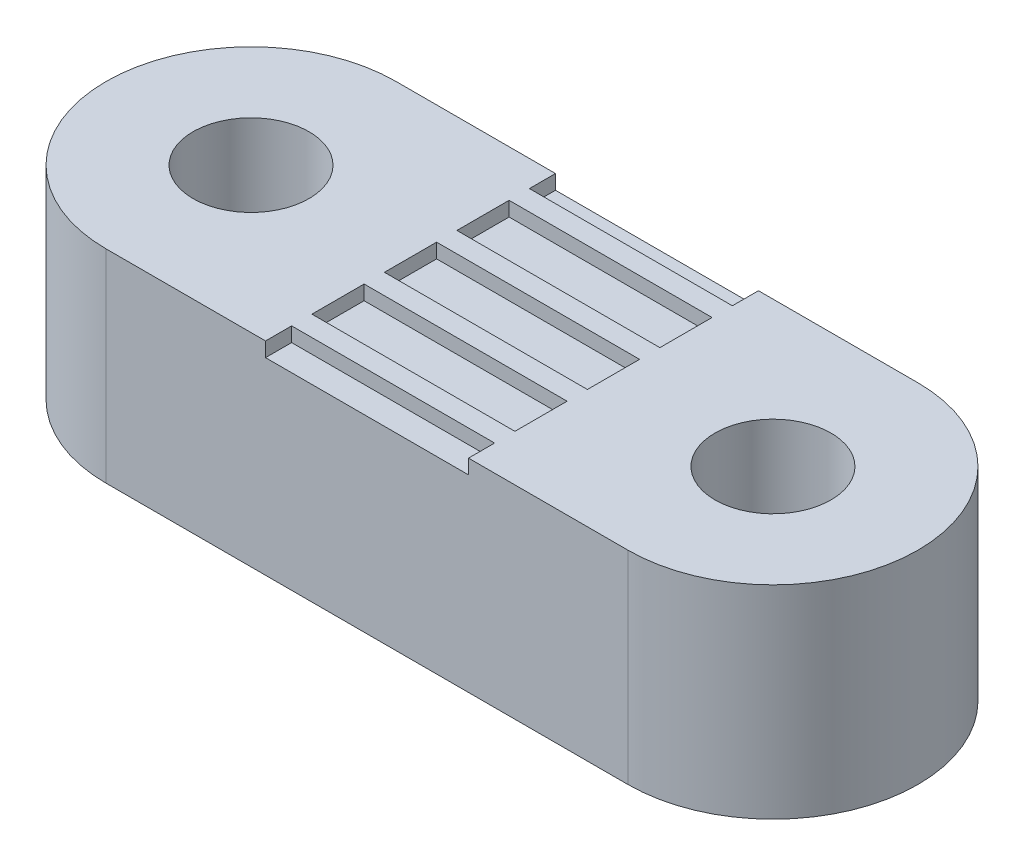
ISO-10303-21;
HEADER;
FILE_DESCRIPTION(('STEP AP214'),'2;1');
FILE_NAME('part.step','',(''),(''),'','','');
FILE_SCHEMA(('AUTOMOTIVE_DESIGN { 1 0 10303 214 1 1 1 1 }'));
ENDSEC;
DATA;
#1=APPLICATION_CONTEXT('core data for automotive mechanical design processes');
#2=APPLICATION_PROTOCOL_DEFINITION('international standard','automotive_design',2000,#1);
#3=PRODUCT_CONTEXT('',#1,'mechanical');
#4=PRODUCT('Part','Part','',(#3));
#5=PRODUCT_RELATED_PRODUCT_CATEGORY('part','',(#4));
#6=PRODUCT_DEFINITION_FORMATION('','',#4);
#7=PRODUCT_DEFINITION_CONTEXT('part definition',#1,'design');
#8=PRODUCT_DEFINITION('design','',#6,#7);
#9=PRODUCT_DEFINITION_SHAPE('','',#8);
#10=(LENGTH_UNIT() NAMED_UNIT(*) SI_UNIT(.MILLI.,.METRE.));
#11=(NAMED_UNIT(*) PLANE_ANGLE_UNIT() SI_UNIT($,.RADIAN.));
#12=(NAMED_UNIT(*) SI_UNIT($,.STERADIAN.) SOLID_ANGLE_UNIT());
#13=UNCERTAINTY_MEASURE_WITH_UNIT(LENGTH_MEASURE(1.E-05),#10,'distance_accuracy_value','');
#14=(GEOMETRIC_REPRESENTATION_CONTEXT(3) GLOBAL_UNCERTAINTY_ASSIGNED_CONTEXT((#13)) GLOBAL_UNIT_ASSIGNED_CONTEXT((#10,
#11,#12)) REPRESENTATION_CONTEXT('',''));
#15=CARTESIAN_POINT('',(0.,0.,0.));
#16=DIRECTION('',(0.,0.,1.));
#17=DIRECTION('',(1.,0.,0.));
#18=AXIS2_PLACEMENT_3D('',#15,#16,#17);
#19=CARTESIAN_POINT('',(-8.99999999999999,7.,0.));
#20=DIRECTION('',(0.,1.,0.));
#21=DIRECTION('',(0.,0.,1.));
#22=AXIS2_PLACEMENT_3D('',#19,#20,#21);
#23=PLANE('',#22);
#24=DIRECTION('',(0.,0.,-1.));
#25=VECTOR('',#24,1.);
#26=CARTESIAN_POINT('',(3.5,7.,4.1));
#27=LINE('',#26,#25);
#28=CARTESIAN_POINT('',(3.5,7.,5.));
#29=VERTEX_POINT('',#28);
#30=CARTESIAN_POINT('',(3.5,7.,4.1));
#31=VERTEX_POINT('',#30);
#32=EDGE_CURVE('E211',#29,#31,#27,.T.);
#33=ORIENTED_EDGE('',*,*,#32,.F.);
#34=DIRECTION('',(1.,0.,0.));
#35=VECTOR('',#34,1.);
#36=CARTESIAN_POINT('',(-8.99999999999999,7.,5.));
#37=LINE('',#36,#35);
#38=CARTESIAN_POINT('',(8.99999999999999,7.,5.));
#39=VERTEX_POINT('',#38);
#40=EDGE_CURVE('E355',#29,#39,#37,.T.);
#41=ORIENTED_EDGE('',*,*,#40,.T.);
#42=CARTESIAN_POINT('',(8.99999999999999,7.,0.));
#43=DIRECTION('',(0.,1.,0.));
#44=DIRECTION('',(0.,0.,1.));
#45=AXIS2_PLACEMENT_3D('',#42,#43,#44);
#46=CIRCLE('',#45,5.);
#47=CARTESIAN_POINT('',(8.99999999999999,7.,-5.));
#48=VERTEX_POINT('',#47);
#49=EDGE_CURVE('E360',#39,#48,#46,.T.);
#50=ORIENTED_EDGE('',*,*,#49,.T.);
#51=DIRECTION('',(-1.,0.,0.));
#52=VECTOR('',#51,1.);
#53=CARTESIAN_POINT('',(-8.99999999999999,7.,-5.));
#54=LINE('',#53,#52);
#55=CARTESIAN_POINT('',(3.5,7.,-5.));
#56=VERTEX_POINT('',#55);
#57=EDGE_CURVE('E363',#48,#56,#54,.T.);
#58=ORIENTED_EDGE('',*,*,#57,.T.);
#59=DIRECTION('',(0.,0.,-1.));
#60=VECTOR('',#59,1.);
#61=CARTESIAN_POINT('',(3.5,7.,-5.9));
#62=LINE('',#61,#60);
#63=CARTESIAN_POINT('',(3.5,7.,-4.1));
#64=VERTEX_POINT('',#63);
#65=EDGE_CURVE('E251',#64,#56,#62,.T.);
#66=ORIENTED_EDGE('',*,*,#65,.F.);
#67=DIRECTION('',(1.,0.,0.));
#68=VECTOR('',#67,1.);
#69=CARTESIAN_POINT('',(-3.5,7.,-4.1));
#70=LINE('',#69,#68);
#71=CARTESIAN_POINT('',(-3.5,7.,-4.1));
#72=VERTEX_POINT('',#71);
#73=EDGE_CURVE('E260',#72,#64,#70,.T.);
#74=ORIENTED_EDGE('',*,*,#73,.F.);
#75=DIRECTION('',(0.,0.,1.));
#76=VECTOR('',#75,1.);
#77=CARTESIAN_POINT('',(-3.5,7.,-5.9));
#78=LINE('',#77,#76);
#79=CARTESIAN_POINT('',(-3.5,7.,-5.));
#80=VERTEX_POINT('',#79);
#81=EDGE_CURVE('E267',#80,#72,#78,.T.);
#82=ORIENTED_EDGE('',*,*,#81,.F.);
#83=CARTESIAN_POINT('',(-8.99999999999999,7.,-5.));
#84=VERTEX_POINT('',#83);
#85=EDGE_CURVE('E362',#80,#84,#54,.T.);
#86=ORIENTED_EDGE('',*,*,#85,.T.);
#87=CARTESIAN_POINT('',(-8.99999999999999,7.,0.));
#88=DIRECTION('',(0.,1.,0.));
#89=DIRECTION('',(0.,0.,1.));
#90=AXIS2_PLACEMENT_3D('',#87,#88,#89);
#91=CIRCLE('',#90,5.);
#92=CARTESIAN_POINT('',(-8.99999999999999,7.,5.));
#93=VERTEX_POINT('',#92);
#94=EDGE_CURVE('E352',#84,#93,#91,.T.);
#95=ORIENTED_EDGE('',*,*,#94,.T.);
#96=CARTESIAN_POINT('',(-3.5,7.,5.));
#97=VERTEX_POINT('',#96);
#98=EDGE_CURVE('E357',#93,#97,#37,.T.);
#99=ORIENTED_EDGE('',*,*,#98,.T.);
#100=DIRECTION('',(0.,0.,1.));
#101=VECTOR('',#100,1.);
#102=CARTESIAN_POINT('',(-3.5,7.,4.1));
#103=LINE('',#102,#101);
#104=CARTESIAN_POINT('',(-3.5,7.,4.1));
#105=VERTEX_POINT('',#104);
#106=EDGE_CURVE('E205',#105,#97,#103,.T.);
#107=ORIENTED_EDGE('',*,*,#106,.F.);
#108=DIRECTION('',(-1.,0.,0.));
#109=VECTOR('',#108,1.);
#110=CARTESIAN_POINT('',(-3.5,7.,4.1));
#111=LINE('',#110,#109);
#112=EDGE_CURVE('E222',#31,#105,#111,.T.);
#113=ORIENTED_EDGE('',*,*,#112,.F.);
#114=EDGE_LOOP('',(#33,#41,#50,#58,#66,#74,#82,#86,#95,#99,#107,#113));
#115=FACE_BOUND('',#114,.T.);
#116=DIRECTION('',(0.,0.,-1.));
#117=VECTOR('',#116,1.);
#118=CARTESIAN_POINT('',(3.5,7.,1.6));
#119=LINE('',#118,#117);
#120=CARTESIAN_POINT('',(3.5,7.,3.4));
#121=VERTEX_POINT('',#120);
#122=CARTESIAN_POINT('',(3.5,7.,1.6));
#123=VERTEX_POINT('',#122);
#124=EDGE_CURVE('E60',#121,#123,#119,.T.);
#125=ORIENTED_EDGE('',*,*,#124,.F.);
#126=DIRECTION('',(1.,0.,0.));
#127=VECTOR('',#126,1.);
#128=CARTESIAN_POINT('',(-3.5,7.,3.4));
#129=LINE('',#128,#127);
#130=CARTESIAN_POINT('',(-3.5,7.,3.4));
#131=VERTEX_POINT('',#130);
#132=EDGE_CURVE('E230',#131,#121,#129,.T.);
#133=ORIENTED_EDGE('',*,*,#132,.F.);
#134=DIRECTION('',(0.,0.,1.));
#135=VECTOR('',#134,1.);
#136=CARTESIAN_POINT('',(-3.5,7.,1.6));
#137=LINE('',#136,#135);
#138=CARTESIAN_POINT('',(-3.5,7.,1.6));
#139=VERTEX_POINT('',#138);
#140=EDGE_CURVE('E244',#139,#131,#137,.T.);
#141=ORIENTED_EDGE('',*,*,#140,.F.);
#142=DIRECTION('',(-1.,0.,0.));
#143=VECTOR('',#142,1.);
#144=CARTESIAN_POINT('',(-3.5,7.,1.6));
#145=LINE('',#144,#143);
#146=EDGE_CURVE('E241',#123,#139,#145,.T.);
#147=ORIENTED_EDGE('',*,*,#146,.F.);
#148=EDGE_LOOP('',(#125,#133,#141,#147));
#149=FACE_BOUND('',#148,.T.);
#150=DIRECTION('',(0.,0.,-1.));
#151=VECTOR('',#150,1.);
#152=CARTESIAN_POINT('',(3.5,7.,-3.4));
#153=LINE('',#152,#151);
#154=CARTESIAN_POINT('',(3.5,7.,-1.6));
#155=VERTEX_POINT('',#154);
#156=CARTESIAN_POINT('',(3.5,7.,-3.4));
#157=VERTEX_POINT('',#156);
#158=EDGE_CURVE('E273',#155,#157,#153,.T.);
#159=ORIENTED_EDGE('',*,*,#158,.F.);
#160=DIRECTION('',(1.,0.,0.));
#161=VECTOR('',#160,1.);
#162=CARTESIAN_POINT('',(-3.5,7.,-1.6));
#163=LINE('',#162,#161);
#164=CARTESIAN_POINT('',(-3.5,7.,-1.6));
#165=VERTEX_POINT('',#164);
#166=EDGE_CURVE('E280',#165,#155,#163,.T.);
#167=ORIENTED_EDGE('',*,*,#166,.F.);
#168=DIRECTION('',(0.,0.,1.));
#169=VECTOR('',#168,1.);
#170=CARTESIAN_POINT('',(-3.5,7.,-3.4));
#171=LINE('',#170,#169);
#172=CARTESIAN_POINT('',(-3.5,7.,-3.4));
#173=VERTEX_POINT('',#172);
#174=EDGE_CURVE('E294',#173,#165,#171,.T.);
#175=ORIENTED_EDGE('',*,*,#174,.F.);
#176=DIRECTION('',(-1.,0.,0.));
#177=VECTOR('',#176,1.);
#178=CARTESIAN_POINT('',(-3.5,7.,-3.4));
#179=LINE('',#178,#177);
#180=EDGE_CURVE('E291',#157,#173,#179,.T.);
#181=ORIENTED_EDGE('',*,*,#180,.F.);
#182=EDGE_LOOP('',(#159,#167,#175,#181));
#183=FACE_BOUND('',#182,.T.);
#184=DIRECTION('',(0.,0.,-1.));
#185=VECTOR('',#184,1.);
#186=CARTESIAN_POINT('',(3.5,7.,-0.9));
#187=LINE('',#186,#185);
#188=CARTESIAN_POINT('',(3.5,7.,0.9));
#189=VERTEX_POINT('',#188);
#190=CARTESIAN_POINT('',(3.5,7.,-0.9));
#191=VERTEX_POINT('',#190);
#192=EDGE_CURVE('E301',#189,#191,#187,.T.);
#193=ORIENTED_EDGE('',*,*,#192,.F.);
#194=DIRECTION('',(1.,0.,0.));
#195=VECTOR('',#194,1.);
#196=CARTESIAN_POINT('',(-3.5,7.,0.9));
#197=LINE('',#196,#195);
#198=CARTESIAN_POINT('',(-3.5,7.,0.9));
#199=VERTEX_POINT('',#198);
#200=EDGE_CURVE('E312',#199,#189,#197,.T.);
#201=ORIENTED_EDGE('',*,*,#200,.F.);
#202=DIRECTION('',(0.,0.,1.));
#203=VECTOR('',#202,1.);
#204=CARTESIAN_POINT('',(-3.5,7.,-0.9));
#205=LINE('',#204,#203);
#206=CARTESIAN_POINT('',(-3.5,7.,-0.9));
#207=VERTEX_POINT('',#206);
#208=EDGE_CURVE('E326',#207,#199,#205,.T.);
#209=ORIENTED_EDGE('',*,*,#208,.F.);
#210=DIRECTION('',(-1.,0.,0.));
#211=VECTOR('',#210,1.);
#212=CARTESIAN_POINT('',(-3.5,7.,-0.9));
#213=LINE('',#212,#211);
#214=EDGE_CURVE('E323',#191,#207,#213,.T.);
#215=ORIENTED_EDGE('',*,*,#214,.F.);
#216=EDGE_LOOP('',(#193,#201,#209,#215));
#217=FACE_BOUND('',#216,.T.);
#218=CARTESIAN_POINT('',(-8.99999999999999,7.,0.));
#219=DIRECTION('',(0.,1.,0.));
#220=DIRECTION('',(0.,0.,1.));
#221=AXIS2_PLACEMENT_3D('',#218,#219,#220);
#222=CIRCLE('',#221,2.);
#223=CARTESIAN_POINT('',(-8.99999999999999,7.,2.));
#224=VERTEX_POINT('',#223);
#225=EDGE_CURVE('E346',#224,#224,#222,.T.);
#226=ORIENTED_EDGE('',*,*,#225,.F.);
#227=EDGE_LOOP('',(#226));
#228=FACE_BOUND('',#227,.T.);
#229=CARTESIAN_POINT('',(8.99999999999999,7.,0.));
#230=DIRECTION('',(0.,1.,0.));
#231=DIRECTION('',(0.,0.,1.));
#232=AXIS2_PLACEMENT_3D('',#229,#230,#231);
#233=CIRCLE('',#232,2.);
#234=CARTESIAN_POINT('',(8.99999999999999,7.,1.99999999999999));
#235=VERTEX_POINT('',#234);
#236=EDGE_CURVE('E340',#235,#235,#233,.T.);
#237=ORIENTED_EDGE('',*,*,#236,.F.);
#238=EDGE_LOOP('',(#237));
#239=FACE_BOUND('',#238,.T.);
#240=ADVANCED_FACE('F37',(#115,#149,#183,#217,#228,#239),#23,.T.);
#241=CARTESIAN_POINT('',(-8.99999999999999,0.,0.));
#242=DIRECTION('',(0.,1.,0.));
#243=DIRECTION('',(0.,0.,1.));
#244=AXIS2_PLACEMENT_3D('',#241,#242,#243);
#245=PLANE('',#244);
#246=CARTESIAN_POINT('',(-8.99999999999999,0.,0.));
#247=DIRECTION('',(0.,1.,0.));
#248=DIRECTION('',(0.,0.,1.));
#249=AXIS2_PLACEMENT_3D('',#246,#247,#248);
#250=CIRCLE('',#249,2.);
#251=CARTESIAN_POINT('',(-8.99999999999999,0.,2.));
#252=VERTEX_POINT('',#251);
#253=EDGE_CURVE('E343',#252,#252,#250,.T.);
#254=ORIENTED_EDGE('',*,*,#253,.T.);
#255=EDGE_LOOP('',(#254));
#256=FACE_BOUND('',#255,.T.);
#257=CARTESIAN_POINT('',(-8.99999999999999,0.,0.));
#258=DIRECTION('',(0.,1.,0.));
#259=DIRECTION('',(0.,0.,1.));
#260=AXIS2_PLACEMENT_3D('',#257,#258,#259);
#261=CIRCLE('',#260,5.);
#262=CARTESIAN_POINT('',(-8.99999999999999,0.,-5.));
#263=VERTEX_POINT('',#262);
#264=CARTESIAN_POINT('',(-8.99999999999999,0.,5.));
#265=VERTEX_POINT('',#264);
#266=EDGE_CURVE('E349',#263,#265,#261,.T.);
#267=ORIENTED_EDGE('',*,*,#266,.F.);
#268=DIRECTION('',(-1.,0.,0.));
#269=VECTOR('',#268,1.);
#270=CARTESIAN_POINT('',(-8.99999999999999,0.,-5.));
#271=LINE('',#270,#269);
#272=CARTESIAN_POINT('',(8.99999999999999,0.,-5.));
#273=VERTEX_POINT('',#272);
#274=EDGE_CURVE('E356',#273,#263,#271,.T.);
#275=ORIENTED_EDGE('',*,*,#274,.F.);
#276=CARTESIAN_POINT('',(8.99999999999999,0.,0.));
#277=DIRECTION('',(0.,1.,0.));
#278=DIRECTION('',(0.,0.,1.));
#279=AXIS2_PLACEMENT_3D('',#276,#277,#278);
#280=CIRCLE('',#279,5.);
#281=CARTESIAN_POINT('',(8.99999999999999,0.,5.));
#282=VERTEX_POINT('',#281);
#283=EDGE_CURVE('E371',#282,#273,#280,.T.);
#284=ORIENTED_EDGE('',*,*,#283,.F.);
#285=DIRECTION('',(1.,0.,0.));
#286=VECTOR('',#285,1.);
#287=CARTESIAN_POINT('',(-8.99999999999999,0.,5.));
#288=LINE('',#287,#286);
#289=EDGE_CURVE('E369',#265,#282,#288,.T.);
#290=ORIENTED_EDGE('',*,*,#289,.F.);
#291=EDGE_LOOP('',(#267,#275,#284,#290));
#292=FACE_BOUND('',#291,.T.);
#293=CARTESIAN_POINT('',(8.99999999999999,0.,0.));
#294=DIRECTION('',(0.,1.,0.));
#295=DIRECTION('',(0.,0.,1.));
#296=AXIS2_PLACEMENT_3D('',#293,#294,#295);
#297=CIRCLE('',#296,2.);
#298=CARTESIAN_POINT('',(8.99999999999999,0.,1.99999999999999));
#299=VERTEX_POINT('',#298);
#300=EDGE_CURVE('E333',#299,#299,#297,.T.);
#301=ORIENTED_EDGE('',*,*,#300,.T.);
#302=EDGE_LOOP('',(#301));
#303=FACE_BOUND('',#302,.T.);
#304=ADVANCED_FACE('F416',(#256,#292,#303),#245,.F.);
#305=CARTESIAN_POINT('',(-8.99999999999999,7.,0.));
#306=DIRECTION('',(0.,-1.,0.));
#307=DIRECTION('',(0.,0.,-1.));
#308=AXIS2_PLACEMENT_3D('',#305,#306,#307);
#309=CYLINDRICAL_SURFACE('',#308,5.);
#310=ORIENTED_EDGE('',*,*,#266,.T.);
#311=DIRECTION('',(0.,-1.,0.));
#312=VECTOR('',#311,1.);
#313=CARTESIAN_POINT('',(-8.99999999999999,7.,5.));
#314=LINE('',#313,#312);
#315=EDGE_CURVE('E382',#93,#265,#314,.T.);
#316=ORIENTED_EDGE('',*,*,#315,.F.);
#317=ORIENTED_EDGE('',*,*,#94,.F.);
#318=DIRECTION('',(0.,-1.,0.));
#319=VECTOR('',#318,1.);
#320=CARTESIAN_POINT('',(-8.99999999999999,7.,-5.));
#321=LINE('',#320,#319);
#322=EDGE_CURVE('E366',#84,#263,#321,.T.);
#323=ORIENTED_EDGE('',*,*,#322,.T.);
#324=EDGE_LOOP('',(#310,#316,#317,#323));
#325=FACE_BOUND('',#324,.T.);
#326=ADVANCED_FACE('F39',(#325),#309,.T.);
#327=CARTESIAN_POINT('',(-8.99999999999999,7.,5.));
#328=DIRECTION('',(0.,0.,-1.));
#329=DIRECTION('',(-1.,0.,0.));
#330=AXIS2_PLACEMENT_3D('',#327,#328,#329);
#331=PLANE('',#330);
#332=ORIENTED_EDGE('',*,*,#40,.F.);
#333=DIRECTION('',(0.,-1.,0.));
#334=VECTOR('',#333,1.);
#335=CARTESIAN_POINT('',(3.5,7.,5.));
#336=LINE('',#335,#334);
#337=CARTESIAN_POINT('',(3.5,6.5,5.));
#338=VERTEX_POINT('',#337);
#339=EDGE_CURVE('E11',#29,#338,#336,.T.);
#340=ORIENTED_EDGE('',*,*,#339,.T.);
#341=DIRECTION('',(1.,0.,0.));
#342=VECTOR('',#341,1.);
#343=CARTESIAN_POINT('',(-8.99999999999999,6.5,5.));
#344=LINE('',#343,#342);
#345=CARTESIAN_POINT('',(-3.5,6.5,5.));
#346=VERTEX_POINT('',#345);
#347=EDGE_CURVE('E203',#346,#338,#344,.T.);
#348=ORIENTED_EDGE('',*,*,#347,.F.);
#349=DIRECTION('',(0.,1.,0.));
#350=VECTOR('',#349,1.);
#351=CARTESIAN_POINT('',(-3.5,7.,5.));
#352=LINE('',#351,#350);
#353=EDGE_CURVE('E45',#346,#97,#352,.T.);
#354=ORIENTED_EDGE('',*,*,#353,.T.);
#355=ORIENTED_EDGE('',*,*,#98,.F.);
#356=ORIENTED_EDGE('',*,*,#315,.T.);
#357=ORIENTED_EDGE('',*,*,#289,.T.);
#358=DIRECTION('',(0.,-1.,0.));
#359=VECTOR('',#358,1.);
#360=CARTESIAN_POINT('',(8.99999999999999,7.,5.));
#361=LINE('',#360,#359);
#362=EDGE_CURVE('E379',#39,#282,#361,.T.);
#363=ORIENTED_EDGE('',*,*,#362,.F.);
#364=EDGE_LOOP('',(#332,#340,#348,#354,#355,#356,#357,#363));
#365=FACE_BOUND('',#364,.T.);
#366=ADVANCED_FACE('F396',(#365),#331,.F.);
#367=CARTESIAN_POINT('',(8.99999999999999,7.,0.));
#368=DIRECTION('',(0.,-1.,0.));
#369=DIRECTION('',(0.,0.,-1.));
#370=AXIS2_PLACEMENT_3D('',#367,#368,#369);
#371=CYLINDRICAL_SURFACE('',#370,5.);
#372=ORIENTED_EDGE('',*,*,#283,.T.);
#373=DIRECTION('',(0.,-1.,0.));
#374=VECTOR('',#373,1.);
#375=CARTESIAN_POINT('',(8.99999999999999,7.,-5.));
#376=LINE('',#375,#374);
#377=EDGE_CURVE('E376',#48,#273,#376,.T.);
#378=ORIENTED_EDGE('',*,*,#377,.F.);
#379=ORIENTED_EDGE('',*,*,#49,.F.);
#380=ORIENTED_EDGE('',*,*,#362,.T.);
#381=EDGE_LOOP('',(#372,#378,#379,#380));
#382=FACE_BOUND('',#381,.T.);
#383=ADVANCED_FACE('F413',(#382),#371,.T.);
#384=CARTESIAN_POINT('',(-8.99999999999999,7.,-5.));
#385=DIRECTION('',(0.,0.,1.));
#386=DIRECTION('',(1.,0.,0.));
#387=AXIS2_PLACEMENT_3D('',#384,#385,#386);
#388=PLANE('',#387);
#389=DIRECTION('',(-1.,0.,0.));
#390=VECTOR('',#389,1.);
#391=CARTESIAN_POINT('',(-8.99999999999999,6.5,-5.));
#392=LINE('',#391,#390);
#393=CARTESIAN_POINT('',(3.5,6.5,-5.));
#394=VERTEX_POINT('',#393);
#395=CARTESIAN_POINT('',(-3.5,6.5,-5.));
#396=VERTEX_POINT('',#395);
#397=EDGE_CURVE('E385',#394,#396,#392,.T.);
#398=ORIENTED_EDGE('',*,*,#397,.F.);
#399=DIRECTION('',(0.,1.,0.));
#400=VECTOR('',#399,1.);
#401=CARTESIAN_POINT('',(3.5,7.,-5.));
#402=LINE('',#401,#400);
#403=EDGE_CURVE('E390',#394,#56,#402,.T.);
#404=ORIENTED_EDGE('',*,*,#403,.T.);
#405=ORIENTED_EDGE('',*,*,#57,.F.);
#406=ORIENTED_EDGE('',*,*,#377,.T.);
#407=ORIENTED_EDGE('',*,*,#274,.T.);
#408=ORIENTED_EDGE('',*,*,#322,.F.);
#409=ORIENTED_EDGE('',*,*,#85,.F.);
#410=DIRECTION('',(0.,-1.,0.));
#411=VECTOR('',#410,1.);
#412=CARTESIAN_POINT('',(-3.5,7.,-5.));
#413=LINE('',#412,#411);
#414=EDGE_CURVE('E387',#80,#396,#413,.T.);
#415=ORIENTED_EDGE('',*,*,#414,.T.);
#416=EDGE_LOOP('',(#398,#404,#405,#406,#407,#408,#409,#415));
#417=FACE_BOUND('',#416,.T.);
#418=ADVANCED_FACE('F420',(#417),#388,.F.);
#419=CARTESIAN_POINT('',(-8.99999999999999,7.,0.));
#420=DIRECTION('',(0.,-1.,0.));
#421=DIRECTION('',(0.,0.,-1.));
#422=AXIS2_PLACEMENT_3D('',#419,#420,#421);
#423=CYLINDRICAL_SURFACE('',#422,2.);
#424=ORIENTED_EDGE('',*,*,#225,.T.);
#425=EDGE_LOOP('',(#424));
#426=FACE_BOUND('',#425,.T.);
#427=ORIENTED_EDGE('',*,*,#253,.F.);
#428=EDGE_LOOP('',(#427));
#429=FACE_BOUND('',#428,.T.);
#430=ADVANCED_FACE('F455',(#426,#429),#423,.F.);
#431=CARTESIAN_POINT('',(8.99999999999999,7.,0.));
#432=DIRECTION('',(0.,-1.,0.));
#433=DIRECTION('',(0.,0.,-1.));
#434=AXIS2_PLACEMENT_3D('',#431,#432,#433);
#435=CYLINDRICAL_SURFACE('',#434,2.);
#436=ORIENTED_EDGE('',*,*,#236,.T.);
#437=EDGE_LOOP('',(#436));
#438=FACE_BOUND('',#437,.T.);
#439=ORIENTED_EDGE('',*,*,#300,.F.);
#440=EDGE_LOOP('',(#439));
#441=FACE_BOUND('',#440,.T.);
#442=ADVANCED_FACE('F501',(#438,#441),#435,.F.);
#443=CARTESIAN_POINT('',(3.5,6.5,-0.9));
#444=DIRECTION('',(1.,0.,0.));
#445=DIRECTION('',(0.,0.,-1.));
#446=AXIS2_PLACEMENT_3D('',#443,#444,#445);
#447=PLANE('',#446);
#448=ORIENTED_EDGE('',*,*,#192,.T.);
#449=DIRECTION('',(0.,1.,0.));
#450=VECTOR('',#449,1.);
#451=CARTESIAN_POINT('',(3.5,6.5,-0.9));
#452=LINE('',#451,#450);
#453=CARTESIAN_POINT('',(3.5,6.5,-0.9));
#454=VERTEX_POINT('',#453);
#455=EDGE_CURVE('E321',#454,#191,#452,.T.);
#456=ORIENTED_EDGE('',*,*,#455,.F.);
#457=DIRECTION('',(0.,0.,-1.));
#458=VECTOR('',#457,1.);
#459=CARTESIAN_POINT('',(3.5,6.5,-0.9));
#460=LINE('',#459,#458);
#461=CARTESIAN_POINT('',(3.5,6.5,0.9));
#462=VERTEX_POINT('',#461);
#463=EDGE_CURVE('E308',#462,#454,#460,.T.);
#464=ORIENTED_EDGE('',*,*,#463,.F.);
#465=DIRECTION('',(0.,1.,0.));
#466=VECTOR('',#465,1.);
#467=CARTESIAN_POINT('',(3.5,6.5,0.9));
#468=LINE('',#467,#466);
#469=EDGE_CURVE('E331',#462,#189,#468,.T.);
#470=ORIENTED_EDGE('',*,*,#469,.T.);
#471=EDGE_LOOP('',(#448,#456,#464,#470));
#472=FACE_BOUND('',#471,.T.);
#473=ADVANCED_FACE('F509',(#472),#447,.F.);
#474=CARTESIAN_POINT('',(-3.5,6.5,0.9));
#475=DIRECTION('',(0.,0.,1.));
#476=DIRECTION('',(1.,0.,0.));
#477=AXIS2_PLACEMENT_3D('',#474,#475,#476);
#478=PLANE('',#477);
#479=ORIENTED_EDGE('',*,*,#200,.T.);
#480=ORIENTED_EDGE('',*,*,#469,.F.);
#481=DIRECTION('',(1.,0.,0.));
#482=VECTOR('',#481,1.);
#483=CARTESIAN_POINT('',(-3.5,6.5,0.9));
#484=LINE('',#483,#482);
#485=CARTESIAN_POINT('',(-3.5,6.5,0.9));
#486=VERTEX_POINT('',#485);
#487=EDGE_CURVE('E318',#486,#462,#484,.T.);
#488=ORIENTED_EDGE('',*,*,#487,.F.);
#489=DIRECTION('',(0.,1.,0.));
#490=VECTOR('',#489,1.);
#491=CARTESIAN_POINT('',(-3.5,6.5,0.9));
#492=LINE('',#491,#490);
#493=EDGE_CURVE('E334',#486,#199,#492,.T.);
#494=ORIENTED_EDGE('',*,*,#493,.T.);
#495=EDGE_LOOP('',(#479,#480,#488,#494));
#496=FACE_BOUND('',#495,.T.);
#497=ADVANCED_FACE('F517',(#496),#478,.F.);
#498=CARTESIAN_POINT('',(-3.5,6.5,-0.9));
#499=DIRECTION('',(-1.,0.,0.));
#500=DIRECTION('',(0.,0.,1.));
#501=AXIS2_PLACEMENT_3D('',#498,#499,#500);
#502=PLANE('',#501);
#503=ORIENTED_EDGE('',*,*,#208,.T.);
#504=ORIENTED_EDGE('',*,*,#493,.F.);
#505=DIRECTION('',(0.,0.,1.));
#506=VECTOR('',#505,1.);
#507=CARTESIAN_POINT('',(-3.5,6.5,-0.9));
#508=LINE('',#507,#506);
#509=CARTESIAN_POINT('',(-3.5,6.5,-0.9));
#510=VERTEX_POINT('',#509);
#511=EDGE_CURVE('E315',#510,#486,#508,.T.);
#512=ORIENTED_EDGE('',*,*,#511,.F.);
#513=DIRECTION('',(0.,1.,0.));
#514=VECTOR('',#513,1.);
#515=CARTESIAN_POINT('',(-3.5,6.5,-0.9));
#516=LINE('',#515,#514);
#517=EDGE_CURVE('E336',#510,#207,#516,.T.);
#518=ORIENTED_EDGE('',*,*,#517,.T.);
#519=EDGE_LOOP('',(#503,#504,#512,#518));
#520=FACE_BOUND('',#519,.T.);
#521=ADVANCED_FACE('F526',(#520),#502,.F.);
#522=CARTESIAN_POINT('',(-3.5,6.5,-0.9));
#523=DIRECTION('',(0.,0.,-1.));
#524=DIRECTION('',(-1.,0.,0.));
#525=AXIS2_PLACEMENT_3D('',#522,#523,#524);
#526=PLANE('',#525);
#527=ORIENTED_EDGE('',*,*,#214,.T.);
#528=ORIENTED_EDGE('',*,*,#517,.F.);
#529=DIRECTION('',(-1.,0.,0.));
#530=VECTOR('',#529,1.);
#531=CARTESIAN_POINT('',(-3.5,6.5,-0.9));
#532=LINE('',#531,#530);
#533=EDGE_CURVE('E311',#454,#510,#532,.T.);
#534=ORIENTED_EDGE('',*,*,#533,.F.);
#535=ORIENTED_EDGE('',*,*,#455,.T.);
#536=EDGE_LOOP('',(#527,#528,#534,#535));
#537=FACE_BOUND('',#536,.T.);
#538=ADVANCED_FACE('F535',(#537),#526,.F.);
#539=CARTESIAN_POINT('',(0.,6.5,0.));
#540=DIRECTION('',(0.,1.,0.));
#541=DIRECTION('',(0.,0.,1.));
#542=AXIS2_PLACEMENT_3D('',#539,#540,#541);
#543=PLANE('',#542);
#544=ORIENTED_EDGE('',*,*,#463,.T.);
#545=ORIENTED_EDGE('',*,*,#533,.T.);
#546=ORIENTED_EDGE('',*,*,#511,.T.);
#547=ORIENTED_EDGE('',*,*,#487,.T.);
#548=EDGE_LOOP('',(#544,#545,#546,#547));
#549=FACE_BOUND('',#548,.T.);
#550=ADVANCED_FACE('F544',(#549),#543,.T.);
#551=CARTESIAN_POINT('',(3.5,6.5,-3.4));
#552=DIRECTION('',(1.,0.,0.));
#553=DIRECTION('',(0.,0.,-1.));
#554=AXIS2_PLACEMENT_3D('',#551,#552,#553);
#555=PLANE('',#554);
#556=ORIENTED_EDGE('',*,*,#158,.T.);
#557=DIRECTION('',(0.,1.,0.));
#558=VECTOR('',#557,1.);
#559=CARTESIAN_POINT('',(3.5,6.5,-3.4));
#560=LINE('',#559,#558);
#561=CARTESIAN_POINT('',(3.5,6.5,-3.4));
#562=VERTEX_POINT('',#561);
#563=EDGE_CURVE('E289',#562,#157,#560,.T.);
#564=ORIENTED_EDGE('',*,*,#563,.F.);
#565=DIRECTION('',(0.,0.,-1.));
#566=VECTOR('',#565,1.);
#567=CARTESIAN_POINT('',(3.5,6.5,-3.4));
#568=LINE('',#567,#566);
#569=CARTESIAN_POINT('',(3.5,6.5,-1.6));
#570=VERTEX_POINT('',#569);
#571=EDGE_CURVE('E276',#570,#562,#568,.T.);
#572=ORIENTED_EDGE('',*,*,#571,.F.);
#573=DIRECTION('',(0.,1.,0.));
#574=VECTOR('',#573,1.);
#575=CARTESIAN_POINT('',(3.5,6.5,-1.6));
#576=LINE('',#575,#574);
#577=EDGE_CURVE('E299',#570,#155,#576,.T.);
#578=ORIENTED_EDGE('',*,*,#577,.T.);
#579=EDGE_LOOP('',(#556,#564,#572,#578));
#580=FACE_BOUND('',#579,.T.);
#581=ADVANCED_FACE('F553',(#580),#555,.F.);
#582=CARTESIAN_POINT('',(-3.5,6.5,-1.6));
#583=DIRECTION('',(0.,0.,1.));
#584=DIRECTION('',(1.,0.,0.));
#585=AXIS2_PLACEMENT_3D('',#582,#583,#584);
#586=PLANE('',#585);
#587=ORIENTED_EDGE('',*,*,#166,.T.);
#588=ORIENTED_EDGE('',*,*,#577,.F.);
#589=DIRECTION('',(1.,0.,0.));
#590=VECTOR('',#589,1.);
#591=CARTESIAN_POINT('',(-3.5,6.5,-1.6));
#592=LINE('',#591,#590);
#593=CARTESIAN_POINT('',(-3.5,6.5,-1.6));
#594=VERTEX_POINT('',#593);
#595=EDGE_CURVE('E286',#594,#570,#592,.T.);
#596=ORIENTED_EDGE('',*,*,#595,.F.);
#597=DIRECTION('',(0.,1.,0.));
#598=VECTOR('',#597,1.);
#599=CARTESIAN_POINT('',(-3.5,6.5,-1.6));
#600=LINE('',#599,#598);
#601=EDGE_CURVE('E302',#594,#165,#600,.T.);
#602=ORIENTED_EDGE('',*,*,#601,.T.);
#603=EDGE_LOOP('',(#587,#588,#596,#602));
#604=FACE_BOUND('',#603,.T.);
#605=ADVANCED_FACE('F561',(#604),#586,.F.);
#606=CARTESIAN_POINT('',(-3.5,6.5,-3.4));
#607=DIRECTION('',(-1.,0.,0.));
#608=DIRECTION('',(0.,0.,1.));
#609=AXIS2_PLACEMENT_3D('',#606,#607,#608);
#610=PLANE('',#609);
#611=ORIENTED_EDGE('',*,*,#174,.T.);
#612=ORIENTED_EDGE('',*,*,#601,.F.);
#613=DIRECTION('',(0.,0.,1.));
#614=VECTOR('',#613,1.);
#615=CARTESIAN_POINT('',(-3.5,6.5,-3.4));
#616=LINE('',#615,#614);
#617=CARTESIAN_POINT('',(-3.5,6.5,-3.4));
#618=VERTEX_POINT('',#617);
#619=EDGE_CURVE('E283',#618,#594,#616,.T.);
#620=ORIENTED_EDGE('',*,*,#619,.F.);
#621=DIRECTION('',(0.,1.,0.));
#622=VECTOR('',#621,1.);
#623=CARTESIAN_POINT('',(-3.5,6.5,-3.4));
#624=LINE('',#623,#622);
#625=EDGE_CURVE('E304',#618,#173,#624,.T.);
#626=ORIENTED_EDGE('',*,*,#625,.T.);
#627=EDGE_LOOP('',(#611,#612,#620,#626));
#628=FACE_BOUND('',#627,.T.);
#629=ADVANCED_FACE('F570',(#628),#610,.F.);
#630=CARTESIAN_POINT('',(-3.5,6.5,-3.4));
#631=DIRECTION('',(0.,0.,-1.));
#632=DIRECTION('',(-1.,0.,0.));
#633=AXIS2_PLACEMENT_3D('',#630,#631,#632);
#634=PLANE('',#633);
#635=ORIENTED_EDGE('',*,*,#180,.T.);
#636=ORIENTED_EDGE('',*,*,#625,.F.);
#637=DIRECTION('',(-1.,0.,0.));
#638=VECTOR('',#637,1.);
#639=CARTESIAN_POINT('',(-3.5,6.5,-3.4));
#640=LINE('',#639,#638);
#641=EDGE_CURVE('E279',#562,#618,#640,.T.);
#642=ORIENTED_EDGE('',*,*,#641,.F.);
#643=ORIENTED_EDGE('',*,*,#563,.T.);
#644=EDGE_LOOP('',(#635,#636,#642,#643));
#645=FACE_BOUND('',#644,.T.);
#646=ADVANCED_FACE('F579',(#645),#634,.F.);
#647=CARTESIAN_POINT('',(0.,6.5,-2.5));
#648=DIRECTION('',(0.,1.,0.));
#649=DIRECTION('',(0.,0.,1.));
#650=AXIS2_PLACEMENT_3D('',#647,#648,#649);
#651=PLANE('',#650);
#652=ORIENTED_EDGE('',*,*,#571,.T.);
#653=ORIENTED_EDGE('',*,*,#641,.T.);
#654=ORIENTED_EDGE('',*,*,#619,.T.);
#655=ORIENTED_EDGE('',*,*,#595,.T.);
#656=EDGE_LOOP('',(#652,#653,#654,#655));
#657=FACE_BOUND('',#656,.T.);
#658=ADVANCED_FACE('F588',(#657),#651,.T.);
#659=CARTESIAN_POINT('',(3.5,6.5,-5.9));
#660=DIRECTION('',(1.,0.,0.));
#661=DIRECTION('',(0.,0.,-1.));
#662=AXIS2_PLACEMENT_3D('',#659,#660,#661);
#663=PLANE('',#662);
#664=DIRECTION('',(0.,0.,-1.));
#665=VECTOR('',#664,1.);
#666=CARTESIAN_POINT('',(3.5,6.5,-5.9));
#667=LINE('',#666,#665);
#668=CARTESIAN_POINT('',(3.5,6.5,-4.1));
#669=VERTEX_POINT('',#668);
#670=EDGE_CURVE('E257',#669,#394,#667,.T.);
#671=ORIENTED_EDGE('',*,*,#670,.F.);
#672=DIRECTION('',(0.,1.,0.));
#673=VECTOR('',#672,1.);
#674=CARTESIAN_POINT('',(3.5,6.5,-4.1));
#675=LINE('',#674,#673);
#676=EDGE_CURVE('E271',#669,#64,#675,.T.);
#677=ORIENTED_EDGE('',*,*,#676,.T.);
#678=ORIENTED_EDGE('',*,*,#65,.T.);
#679=ORIENTED_EDGE('',*,*,#403,.F.);
#680=EDGE_LOOP('',(#671,#677,#678,#679));
#681=FACE_BOUND('',#680,.T.);
#682=ADVANCED_FACE('F427',(#681),#663,.F.);
#683=CARTESIAN_POINT('',(-3.5,6.5,-5.9));
#684=DIRECTION('',(-1.,0.,0.));
#685=DIRECTION('',(0.,0.,1.));
#686=AXIS2_PLACEMENT_3D('',#683,#684,#685);
#687=PLANE('',#686);
#688=ORIENTED_EDGE('',*,*,#81,.T.);
#689=DIRECTION('',(0.,1.,0.));
#690=VECTOR('',#689,1.);
#691=CARTESIAN_POINT('',(-3.5,6.5,-4.1));
#692=LINE('',#691,#690);
#693=CARTESIAN_POINT('',(-3.5,6.5,-4.1));
#694=VERTEX_POINT('',#693);
#695=EDGE_CURVE('E265',#694,#72,#692,.T.);
#696=ORIENTED_EDGE('',*,*,#695,.F.);
#697=DIRECTION('',(0.,0.,1.));
#698=VECTOR('',#697,1.);
#699=CARTESIAN_POINT('',(-3.5,6.5,-5.9));
#700=LINE('',#699,#698);
#701=EDGE_CURVE('E259',#396,#694,#700,.T.);
#702=ORIENTED_EDGE('',*,*,#701,.F.);
#703=ORIENTED_EDGE('',*,*,#414,.F.);
#704=EDGE_LOOP('',(#688,#696,#702,#703));
#705=FACE_BOUND('',#704,.T.);
#706=ADVANCED_FACE('F434',(#705),#687,.F.);
#707=CARTESIAN_POINT('',(0.,6.5,-5.));
#708=DIRECTION('',(0.,1.,0.));
#709=DIRECTION('',(0.,0.,1.));
#710=AXIS2_PLACEMENT_3D('',#707,#708,#709);
#711=PLANE('',#710);
#712=ORIENTED_EDGE('',*,*,#397,.T.);
#713=ORIENTED_EDGE('',*,*,#701,.T.);
#714=DIRECTION('',(1.,0.,0.));
#715=VECTOR('',#714,1.);
#716=CARTESIAN_POINT('',(-3.5,6.5,-4.1));
#717=LINE('',#716,#715);
#718=EDGE_CURVE('E262',#694,#669,#717,.T.);
#719=ORIENTED_EDGE('',*,*,#718,.T.);
#720=ORIENTED_EDGE('',*,*,#670,.T.);
#721=EDGE_LOOP('',(#712,#713,#719,#720));
#722=FACE_BOUND('',#721,.T.);
#723=ADVANCED_FACE('F436',(#722),#711,.T.);
#724=CARTESIAN_POINT('',(-3.5,6.5,-4.1));
#725=DIRECTION('',(0.,0.,1.));
#726=DIRECTION('',(1.,0.,0.));
#727=AXIS2_PLACEMENT_3D('',#724,#725,#726);
#728=PLANE('',#727);
#729=ORIENTED_EDGE('',*,*,#73,.T.);
#730=ORIENTED_EDGE('',*,*,#676,.F.);
#731=ORIENTED_EDGE('',*,*,#718,.F.);
#732=ORIENTED_EDGE('',*,*,#695,.T.);
#733=EDGE_LOOP('',(#729,#730,#731,#732));
#734=FACE_BOUND('',#733,.T.);
#735=ADVANCED_FACE('F430',(#734),#728,.F.);
#736=CARTESIAN_POINT('',(3.5,6.5,1.6));
#737=DIRECTION('',(1.,0.,0.));
#738=DIRECTION('',(0.,0.,-1.));
#739=AXIS2_PLACEMENT_3D('',#736,#737,#738);
#740=PLANE('',#739);
#741=ORIENTED_EDGE('',*,*,#124,.T.);
#742=DIRECTION('',(0.,1.,0.));
#743=VECTOR('',#742,1.);
#744=CARTESIAN_POINT('',(3.5,6.5,1.6));
#745=LINE('',#744,#743);
#746=CARTESIAN_POINT('',(3.5,6.5,1.6));
#747=VERTEX_POINT('',#746);
#748=EDGE_CURVE('E239',#747,#123,#745,.T.);
#749=ORIENTED_EDGE('',*,*,#748,.F.);
#750=DIRECTION('',(0.,0.,-1.));
#751=VECTOR('',#750,1.);
#752=CARTESIAN_POINT('',(3.5,6.5,1.6));
#753=LINE('',#752,#751);
#754=CARTESIAN_POINT('',(3.5,6.5,3.4));
#755=VERTEX_POINT('',#754);
#756=EDGE_CURVE('E226',#755,#747,#753,.T.);
#757=ORIENTED_EDGE('',*,*,#756,.F.);
#758=DIRECTION('',(0.,1.,0.));
#759=VECTOR('',#758,1.);
#760=CARTESIAN_POINT('',(3.5,6.5,3.4));
#761=LINE('',#760,#759);
#762=EDGE_CURVE('E249',#755,#121,#761,.T.);
#763=ORIENTED_EDGE('',*,*,#762,.T.);
#764=EDGE_LOOP('',(#741,#749,#757,#763));
#765=FACE_BOUND('',#764,.T.);
#766=ADVANCED_FACE('F443',(#765),#740,.F.);
#767=CARTESIAN_POINT('',(-3.5,6.5,3.4));
#768=DIRECTION('',(0.,0.,1.));
#769=DIRECTION('',(1.,0.,0.));
#770=AXIS2_PLACEMENT_3D('',#767,#768,#769);
#771=PLANE('',#770);
#772=ORIENTED_EDGE('',*,*,#132,.T.);
#773=ORIENTED_EDGE('',*,*,#762,.F.);
#774=DIRECTION('',(1.,0.,0.));
#775=VECTOR('',#774,1.);
#776=CARTESIAN_POINT('',(-3.5,6.5,3.4));
#777=LINE('',#776,#775);
#778=CARTESIAN_POINT('',(-3.5,6.5,3.4));
#779=VERTEX_POINT('',#778);
#780=EDGE_CURVE('E236',#779,#755,#777,.T.);
#781=ORIENTED_EDGE('',*,*,#780,.F.);
#782=DIRECTION('',(0.,1.,0.));
#783=VECTOR('',#782,1.);
#784=CARTESIAN_POINT('',(-3.5,6.5,3.4));
#785=LINE('',#784,#783);
#786=EDGE_CURVE('E252',#779,#131,#785,.T.);
#787=ORIENTED_EDGE('',*,*,#786,.T.);
#788=EDGE_LOOP('',(#772,#773,#781,#787));
#789=FACE_BOUND('',#788,.T.);
#790=ADVANCED_FACE('F626',(#789),#771,.F.);
#791=CARTESIAN_POINT('',(-3.5,6.5,1.6));
#792=DIRECTION('',(-1.,0.,0.));
#793=DIRECTION('',(0.,0.,1.));
#794=AXIS2_PLACEMENT_3D('',#791,#792,#793);
#795=PLANE('',#794);
#796=ORIENTED_EDGE('',*,*,#140,.T.);
#797=ORIENTED_EDGE('',*,*,#786,.F.);
#798=DIRECTION('',(0.,0.,1.));
#799=VECTOR('',#798,1.);
#800=CARTESIAN_POINT('',(-3.5,6.5,1.6));
#801=LINE('',#800,#799);
#802=CARTESIAN_POINT('',(-3.5,6.5,1.6));
#803=VERTEX_POINT('',#802);
#804=EDGE_CURVE('E233',#803,#779,#801,.T.);
#805=ORIENTED_EDGE('',*,*,#804,.F.);
#806=DIRECTION('',(0.,1.,0.));
#807=VECTOR('',#806,1.);
#808=CARTESIAN_POINT('',(-3.5,6.5,1.6));
#809=LINE('',#808,#807);
#810=EDGE_CURVE('E254',#803,#139,#809,.T.);
#811=ORIENTED_EDGE('',*,*,#810,.T.);
#812=EDGE_LOOP('',(#796,#797,#805,#811));
#813=FACE_BOUND('',#812,.T.);
#814=ADVANCED_FACE('F633',(#813),#795,.F.);
#815=CARTESIAN_POINT('',(-3.5,6.5,1.6));
#816=DIRECTION('',(0.,0.,-1.));
#817=DIRECTION('',(-1.,0.,0.));
#818=AXIS2_PLACEMENT_3D('',#815,#816,#817);
#819=PLANE('',#818);
#820=ORIENTED_EDGE('',*,*,#146,.T.);
#821=ORIENTED_EDGE('',*,*,#810,.F.);
#822=DIRECTION('',(-1.,0.,0.));
#823=VECTOR('',#822,1.);
#824=CARTESIAN_POINT('',(-3.5,6.5,1.6));
#825=LINE('',#824,#823);
#826=EDGE_CURVE('E229',#747,#803,#825,.T.);
#827=ORIENTED_EDGE('',*,*,#826,.F.);
#828=ORIENTED_EDGE('',*,*,#748,.T.);
#829=EDGE_LOOP('',(#820,#821,#827,#828));
#830=FACE_BOUND('',#829,.T.);
#831=ADVANCED_FACE('F642',(#830),#819,.F.);
#832=CARTESIAN_POINT('',(0.,6.5,2.5));
#833=DIRECTION('',(0.,1.,0.));
#834=DIRECTION('',(0.,0.,1.));
#835=AXIS2_PLACEMENT_3D('',#832,#833,#834);
#836=PLANE('',#835);
#837=ORIENTED_EDGE('',*,*,#756,.T.);
#838=ORIENTED_EDGE('',*,*,#826,.T.);
#839=ORIENTED_EDGE('',*,*,#804,.T.);
#840=ORIENTED_EDGE('',*,*,#780,.T.);
#841=EDGE_LOOP('',(#837,#838,#839,#840));
#842=FACE_BOUND('',#841,.T.);
#843=ADVANCED_FACE('F651',(#842),#836,.T.);
#844=CARTESIAN_POINT('',(3.5,6.5,4.1));
#845=DIRECTION('',(1.,0.,0.));
#846=DIRECTION('',(0.,0.,-1.));
#847=AXIS2_PLACEMENT_3D('',#844,#845,#846);
#848=PLANE('',#847);
#849=ORIENTED_EDGE('',*,*,#32,.T.);
#850=DIRECTION('',(0.,1.,0.));
#851=VECTOR('',#850,1.);
#852=CARTESIAN_POINT('',(3.5,6.5,4.1));
#853=LINE('',#852,#851);
#854=CARTESIAN_POINT('',(3.5,6.5,4.1));
#855=VERTEX_POINT('',#854);
#856=EDGE_CURVE('E208',#855,#31,#853,.T.);
#857=ORIENTED_EDGE('',*,*,#856,.F.);
#858=DIRECTION('',(0.,0.,-1.));
#859=VECTOR('',#858,1.);
#860=CARTESIAN_POINT('',(3.5,6.5,4.1));
#861=LINE('',#860,#859);
#862=EDGE_CURVE('E197',#338,#855,#861,.T.);
#863=ORIENTED_EDGE('',*,*,#862,.F.);
#864=ORIENTED_EDGE('',*,*,#339,.F.);
#865=EDGE_LOOP('',(#849,#857,#863,#864));
#866=FACE_BOUND('',#865,.T.);
#867=ADVANCED_FACE('F209',(#866),#848,.F.);
#868=CARTESIAN_POINT('',(-3.5,6.5,4.1));
#869=DIRECTION('',(-1.,0.,0.));
#870=DIRECTION('',(0.,0.,1.));
#871=AXIS2_PLACEMENT_3D('',#868,#869,#870);
#872=PLANE('',#871);
#873=DIRECTION('',(0.,0.,1.));
#874=VECTOR('',#873,1.);
#875=CARTESIAN_POINT('',(-3.5,6.5,4.1));
#876=LINE('',#875,#874);
#877=CARTESIAN_POINT('',(-3.5,6.5,4.1));
#878=VERTEX_POINT('',#877);
#879=EDGE_CURVE('E52',#878,#346,#876,.T.);
#880=ORIENTED_EDGE('',*,*,#879,.F.);
#881=DIRECTION('',(0.,1.,0.));
#882=VECTOR('',#881,1.);
#883=CARTESIAN_POINT('',(-3.5,6.5,4.1));
#884=LINE('',#883,#882);
#885=EDGE_CURVE('E215',#878,#105,#884,.T.);
#886=ORIENTED_EDGE('',*,*,#885,.T.);
#887=ORIENTED_EDGE('',*,*,#106,.T.);
#888=ORIENTED_EDGE('',*,*,#353,.F.);
#889=EDGE_LOOP('',(#880,#886,#887,#888));
#890=FACE_BOUND('',#889,.T.);
#891=ADVANCED_FACE('F668',(#890),#872,.F.);
#892=CARTESIAN_POINT('',(0.,6.5,5.));
#893=DIRECTION('',(0.,1.,0.));
#894=DIRECTION('',(0.,0.,1.));
#895=AXIS2_PLACEMENT_3D('',#892,#893,#894);
#896=PLANE('',#895);
#897=ORIENTED_EDGE('',*,*,#347,.T.);
#898=ORIENTED_EDGE('',*,*,#862,.T.);
#899=DIRECTION('',(-1.,0.,0.));
#900=VECTOR('',#899,1.);
#901=CARTESIAN_POINT('',(-3.5,6.5,4.1));
#902=LINE('',#901,#900);
#903=EDGE_CURVE('E201',#855,#878,#902,.T.);
#904=ORIENTED_EDGE('',*,*,#903,.T.);
#905=ORIENTED_EDGE('',*,*,#879,.T.);
#906=EDGE_LOOP('',(#897,#898,#904,#905));
#907=FACE_BOUND('',#906,.T.);
#908=ADVANCED_FACE('F199',(#907),#896,.T.);
#909=CARTESIAN_POINT('',(-3.5,6.5,4.1));
#910=DIRECTION('',(0.,0.,-1.));
#911=DIRECTION('',(-1.,0.,0.));
#912=AXIS2_PLACEMENT_3D('',#909,#910,#911);
#913=PLANE('',#912);
#914=ORIENTED_EDGE('',*,*,#112,.T.);
#915=ORIENTED_EDGE('',*,*,#885,.F.);
#916=ORIENTED_EDGE('',*,*,#903,.F.);
#917=ORIENTED_EDGE('',*,*,#856,.T.);
#918=EDGE_LOOP('',(#914,#915,#916,#917));
#919=FACE_BOUND('',#918,.T.);
#920=ADVANCED_FACE('F217',(#919),#913,.F.);
#921=CLOSED_SHELL('',(#240,#304,#326,#366,#383,#418,#430,#442,#473,#497,#521,#538,#550,#581,
#605,#629,#646,#658,#682,#706,#723,#735,#766,#790,#814,#831,#843,#867,#891,#908,#920));
#922=MANIFOLD_SOLID_BREP('B2',#921);
#923=ADVANCED_BREP_SHAPE_REPRESENTATION('',(#18,#922),#14);
#924=SHAPE_DEFINITION_REPRESENTATION(#9,#923);
ENDSEC;
END-ISO-10303-21;
